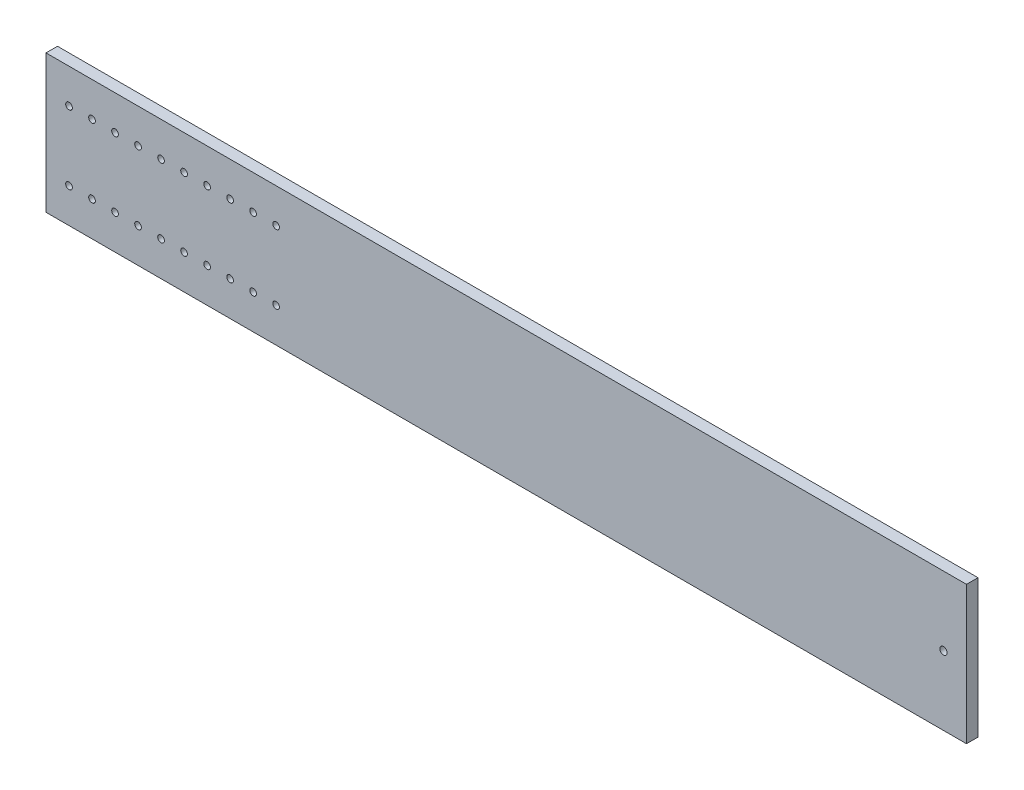
ISO-10303-21;
HEADER;
FILE_DESCRIPTION(('STEP AP214'),'2;1');
FILE_NAME('part.step','',(''),(''),'','','');
FILE_SCHEMA(('AUTOMOTIVE_DESIGN { 1 0 10303 214 1 1 1 1 }'));
ENDSEC;
DATA;
#1=APPLICATION_CONTEXT('core data for automotive mechanical design processes');
#2=APPLICATION_PROTOCOL_DEFINITION('international standard','automotive_design',2000,#1);
#3=PRODUCT_CONTEXT('',#1,'mechanical');
#4=PRODUCT('Part','Part','',(#3));
#5=PRODUCT_RELATED_PRODUCT_CATEGORY('part','',(#4));
#6=PRODUCT_DEFINITION_FORMATION('','',#4);
#7=PRODUCT_DEFINITION_CONTEXT('part definition',#1,'design');
#8=PRODUCT_DEFINITION('design','',#6,#7);
#9=PRODUCT_DEFINITION_SHAPE('','',#8);
#10=(LENGTH_UNIT() NAMED_UNIT(*) SI_UNIT(.MILLI.,.METRE.));
#11=(NAMED_UNIT(*) PLANE_ANGLE_UNIT() SI_UNIT($,.RADIAN.));
#12=(NAMED_UNIT(*) SI_UNIT($,.STERADIAN.) SOLID_ANGLE_UNIT());
#13=UNCERTAINTY_MEASURE_WITH_UNIT(LENGTH_MEASURE(1.E-05),#10,'distance_accuracy_value','');
#14=(GEOMETRIC_REPRESENTATION_CONTEXT(3) GLOBAL_UNCERTAINTY_ASSIGNED_CONTEXT((#13)) GLOBAL_UNIT_ASSIGNED_CONTEXT((#10,
#11,#12)) REPRESENTATION_CONTEXT('',''));
#15=CARTESIAN_POINT('',(0.,0.,0.));
#16=DIRECTION('',(0.,0.,1.));
#17=DIRECTION('',(1.,0.,0.));
#18=AXIS2_PLACEMENT_3D('',#15,#16,#17);
#19=CARTESIAN_POINT('',(0.,0.,6.35));
#20=DIRECTION('',(1.,0.,0.));
#21=DIRECTION('',(0.,0.,-1.));
#22=AXIS2_PLACEMENT_3D('',#19,#20,#21);
#23=PLANE('',#22);
#24=DIRECTION('',(0.,-1.,0.));
#25=VECTOR('',#24,1.);
#26=CARTESIAN_POINT('',(0.,0.,0.));
#27=LINE('',#26,#25);
#28=CARTESIAN_POINT('',(0.,76.2,0.));
#29=VERTEX_POINT('',#28);
#30=CARTESIAN_POINT('',(0.,0.,0.));
#31=VERTEX_POINT('',#30);
#32=EDGE_CURVE('E96',#29,#31,#27,.T.);
#33=ORIENTED_EDGE('',*,*,#32,.T.);
#34=DIRECTION('',(0.,0.,-1.));
#35=VECTOR('',#34,1.);
#36=CARTESIAN_POINT('',(0.,0.,6.35));
#37=LINE('',#36,#35);
#38=CARTESIAN_POINT('',(0.,0.,6.35));
#39=VERTEX_POINT('',#38);
#40=EDGE_CURVE('E11',#39,#31,#37,.T.);
#41=ORIENTED_EDGE('',*,*,#40,.F.);
#42=DIRECTION('',(0.,-1.,0.));
#43=VECTOR('',#42,1.);
#44=CARTESIAN_POINT('',(0.,0.,6.35));
#45=LINE('',#44,#43);
#46=CARTESIAN_POINT('',(0.,76.2,6.35));
#47=VERTEX_POINT('',#46);
#48=EDGE_CURVE('E84',#47,#39,#45,.T.);
#49=ORIENTED_EDGE('',*,*,#48,.F.);
#50=DIRECTION('',(0.,0.,-1.));
#51=VECTOR('',#50,1.);
#52=CARTESIAN_POINT('',(0.,76.2,6.35));
#53=LINE('',#52,#51);
#54=EDGE_CURVE('E92',#47,#29,#53,.T.);
#55=ORIENTED_EDGE('',*,*,#54,.T.);
#56=EDGE_LOOP('',(#33,#41,#49,#55));
#57=FACE_BOUND('',#56,.T.);
#58=ADVANCED_FACE('F33',(#57),#23,.F.);
#59=CARTESIAN_POINT('',(0.,0.,6.35));
#60=DIRECTION('',(0.,1.,0.));
#61=DIRECTION('',(0.,0.,1.));
#62=AXIS2_PLACEMENT_3D('',#59,#60,#61);
#63=PLANE('',#62);
#64=DIRECTION('',(1.,0.,0.));
#65=VECTOR('',#64,1.);
#66=CARTESIAN_POINT('',(0.,0.,0.));
#67=LINE('',#66,#65);
#68=CARTESIAN_POINT('',(508.,0.,0.));
#69=VERTEX_POINT('',#68);
#70=EDGE_CURVE('E88',#31,#69,#67,.T.);
#71=ORIENTED_EDGE('',*,*,#70,.T.);
#72=DIRECTION('',(0.,0.,-1.));
#73=VECTOR('',#72,1.);
#74=CARTESIAN_POINT('',(508.,0.,6.35));
#75=LINE('',#74,#73);
#76=CARTESIAN_POINT('',(508.,0.,6.35));
#77=VERTEX_POINT('',#76);
#78=EDGE_CURVE('E41',#77,#69,#75,.T.);
#79=ORIENTED_EDGE('',*,*,#78,.F.);
#80=DIRECTION('',(1.,0.,0.));
#81=VECTOR('',#80,1.);
#82=CARTESIAN_POINT('',(0.,0.,6.35));
#83=LINE('',#82,#81);
#84=EDGE_CURVE('E79',#39,#77,#83,.T.);
#85=ORIENTED_EDGE('',*,*,#84,.F.);
#86=ORIENTED_EDGE('',*,*,#40,.T.);
#87=EDGE_LOOP('',(#71,#79,#85,#86));
#88=FACE_BOUND('',#87,.T.);
#89=ADVANCED_FACE('F87',(#88),#63,.F.);
#90=CARTESIAN_POINT('',(508.,0.,6.35));
#91=DIRECTION('',(-1.,0.,0.));
#92=DIRECTION('',(0.,0.,1.));
#93=AXIS2_PLACEMENT_3D('',#90,#91,#92);
#94=PLANE('',#93);
#95=DIRECTION('',(0.,1.,0.));
#96=VECTOR('',#95,1.);
#97=CARTESIAN_POINT('',(508.,0.,0.));
#98=LINE('',#97,#96);
#99=CARTESIAN_POINT('',(508.,76.2,0.));
#100=VERTEX_POINT('',#99);
#101=EDGE_CURVE('E66',#69,#100,#98,.T.);
#102=ORIENTED_EDGE('',*,*,#101,.T.);
#103=DIRECTION('',(0.,0.,-1.));
#104=VECTOR('',#103,1.);
#105=CARTESIAN_POINT('',(508.,76.2,6.35));
#106=LINE('',#105,#104);
#107=CARTESIAN_POINT('',(508.,76.2,6.35));
#108=VERTEX_POINT('',#107);
#109=EDGE_CURVE('E89',#108,#100,#106,.T.);
#110=ORIENTED_EDGE('',*,*,#109,.F.);
#111=DIRECTION('',(0.,1.,0.));
#112=VECTOR('',#111,1.);
#113=CARTESIAN_POINT('',(508.,0.,6.35));
#114=LINE('',#113,#112);
#115=EDGE_CURVE('E82',#77,#108,#114,.T.);
#116=ORIENTED_EDGE('',*,*,#115,.F.);
#117=ORIENTED_EDGE('',*,*,#78,.T.);
#118=EDGE_LOOP('',(#102,#110,#116,#117));
#119=FACE_BOUND('',#118,.T.);
#120=ADVANCED_FACE('F90',(#119),#94,.F.);
#121=CARTESIAN_POINT('',(0.,76.2,6.35));
#122=DIRECTION('',(0.,-1.,0.));
#123=DIRECTION('',(0.,0.,-1.));
#124=AXIS2_PLACEMENT_3D('',#121,#122,#123);
#125=PLANE('',#124);
#126=DIRECTION('',(-1.,0.,0.));
#127=VECTOR('',#126,1.);
#128=CARTESIAN_POINT('',(0.,76.2,0.));
#129=LINE('',#128,#127);
#130=EDGE_CURVE('E72',#100,#29,#129,.T.);
#131=ORIENTED_EDGE('',*,*,#130,.T.);
#132=ORIENTED_EDGE('',*,*,#54,.F.);
#133=DIRECTION('',(-1.,0.,0.));
#134=VECTOR('',#133,1.);
#135=CARTESIAN_POINT('',(0.,76.2,6.35));
#136=LINE('',#135,#134);
#137=EDGE_CURVE('E49',#108,#47,#136,.T.);
#138=ORIENTED_EDGE('',*,*,#137,.F.);
#139=ORIENTED_EDGE('',*,*,#109,.T.);
#140=EDGE_LOOP('',(#131,#132,#138,#139));
#141=FACE_BOUND('',#140,.T.);
#142=ADVANCED_FACE('F104',(#141),#125,.F.);
#143=CARTESIAN_POINT('',(0.,76.2,6.35));
#144=DIRECTION('',(0.,0.,-1.));
#145=DIRECTION('',(-1.,0.,0.));
#146=AXIS2_PLACEMENT_3D('',#143,#144,#145);
#147=PLANE('',#146);
#148=CARTESIAN_POINT('',(495.3,38.1,6.35));
#149=DIRECTION('',(0.,0.,1.));
#150=DIRECTION('',(1.,0.,0.));
#151=AXIS2_PLACEMENT_3D('',#148,#149,#150);
#152=CIRCLE('',#151,2.00660000000001);
#153=CARTESIAN_POINT('',(497.3066,38.1,6.35));
#154=VERTEX_POINT('',#153);
#155=EDGE_CURVE('E230',#154,#154,#152,.T.);
#156=ORIENTED_EDGE('',*,*,#155,.F.);
#157=EDGE_LOOP('',(#156));
#158=FACE_BOUND('',#157,.T.);
#159=CARTESIAN_POINT('',(127.,19.05,6.35));
#160=DIRECTION('',(0.,0.,1.));
#161=DIRECTION('',(1.,0.,0.));
#162=AXIS2_PLACEMENT_3D('',#159,#160,#161);
#163=CIRCLE('',#162,1.84150000000001);
#164=CARTESIAN_POINT('',(128.8415,19.05,6.35));
#165=VERTEX_POINT('',#164);
#166=EDGE_CURVE('E224',#165,#165,#163,.T.);
#167=ORIENTED_EDGE('',*,*,#166,.F.);
#168=EDGE_LOOP('',(#167));
#169=FACE_BOUND('',#168,.T.);
#170=CARTESIAN_POINT('',(114.3,19.05,6.35));
#171=DIRECTION('',(0.,0.,1.));
#172=DIRECTION('',(1.,0.,0.));
#173=AXIS2_PLACEMENT_3D('',#170,#171,#172);
#174=CIRCLE('',#173,1.8415);
#175=CARTESIAN_POINT('',(116.1415,19.05,6.35));
#176=VERTEX_POINT('',#175);
#177=EDGE_CURVE('E218',#176,#176,#174,.T.);
#178=ORIENTED_EDGE('',*,*,#177,.F.);
#179=EDGE_LOOP('',(#178));
#180=FACE_BOUND('',#179,.T.);
#181=CARTESIAN_POINT('',(101.6,19.05,6.35));
#182=DIRECTION('',(0.,0.,1.));
#183=DIRECTION('',(1.,0.,0.));
#184=AXIS2_PLACEMENT_3D('',#181,#182,#183);
#185=CIRCLE('',#184,1.8415);
#186=CARTESIAN_POINT('',(103.4415,19.05,6.35));
#187=VERTEX_POINT('',#186);
#188=EDGE_CURVE('E212',#187,#187,#185,.T.);
#189=ORIENTED_EDGE('',*,*,#188,.F.);
#190=EDGE_LOOP('',(#189));
#191=FACE_BOUND('',#190,.T.);
#192=CARTESIAN_POINT('',(88.9000000000004,19.05,6.35));
#193=DIRECTION('',(0.,0.,1.));
#194=DIRECTION('',(1.,0.,0.));
#195=AXIS2_PLACEMENT_3D('',#192,#193,#194);
#196=CIRCLE('',#195,1.8415);
#197=CARTESIAN_POINT('',(90.7415000000004,19.05,6.35));
#198=VERTEX_POINT('',#197);
#199=EDGE_CURVE('E206',#198,#198,#196,.T.);
#200=ORIENTED_EDGE('',*,*,#199,.F.);
#201=EDGE_LOOP('',(#200));
#202=FACE_BOUND('',#201,.T.);
#203=CARTESIAN_POINT('',(76.2000000000004,19.05,6.35));
#204=DIRECTION('',(0.,0.,1.));
#205=DIRECTION('',(1.,0.,0.));
#206=AXIS2_PLACEMENT_3D('',#203,#204,#205);
#207=CIRCLE('',#206,1.8415);
#208=CARTESIAN_POINT('',(78.0415000000004,19.05,6.35));
#209=VERTEX_POINT('',#208);
#210=EDGE_CURVE('E200',#209,#209,#207,.T.);
#211=ORIENTED_EDGE('',*,*,#210,.F.);
#212=EDGE_LOOP('',(#211));
#213=FACE_BOUND('',#212,.T.);
#214=CARTESIAN_POINT('',(63.5000000000004,19.05,6.35));
#215=DIRECTION('',(0.,0.,1.));
#216=DIRECTION('',(1.,0.,0.));
#217=AXIS2_PLACEMENT_3D('',#214,#215,#216);
#218=CIRCLE('',#217,1.8415);
#219=CARTESIAN_POINT('',(65.3415000000004,19.05,6.35));
#220=VERTEX_POINT('',#219);
#221=EDGE_CURVE('E194',#220,#220,#218,.T.);
#222=ORIENTED_EDGE('',*,*,#221,.F.);
#223=EDGE_LOOP('',(#222));
#224=FACE_BOUND('',#223,.T.);
#225=CARTESIAN_POINT('',(50.8000000000004,19.05,6.35));
#226=DIRECTION('',(0.,0.,1.));
#227=DIRECTION('',(1.,0.,0.));
#228=AXIS2_PLACEMENT_3D('',#225,#226,#227);
#229=CIRCLE('',#228,1.8415);
#230=CARTESIAN_POINT('',(52.6415000000004,19.05,6.35));
#231=VERTEX_POINT('',#230);
#232=EDGE_CURVE('E188',#231,#231,#229,.T.);
#233=ORIENTED_EDGE('',*,*,#232,.F.);
#234=EDGE_LOOP('',(#233));
#235=FACE_BOUND('',#234,.T.);
#236=CARTESIAN_POINT('',(38.1000000000004,19.05,6.35));
#237=DIRECTION('',(0.,0.,1.));
#238=DIRECTION('',(1.,0.,0.));
#239=AXIS2_PLACEMENT_3D('',#236,#237,#238);
#240=CIRCLE('',#239,1.8415);
#241=CARTESIAN_POINT('',(39.9415000000004,19.05,6.35));
#242=VERTEX_POINT('',#241);
#243=EDGE_CURVE('E182',#242,#242,#240,.T.);
#244=ORIENTED_EDGE('',*,*,#243,.F.);
#245=EDGE_LOOP('',(#244));
#246=FACE_BOUND('',#245,.T.);
#247=CARTESIAN_POINT('',(25.4000000000004,19.05,6.35));
#248=DIRECTION('',(0.,0.,1.));
#249=DIRECTION('',(1.,0.,0.));
#250=AXIS2_PLACEMENT_3D('',#247,#248,#249);
#251=CIRCLE('',#250,1.8415);
#252=CARTESIAN_POINT('',(27.2415000000004,19.05,6.35));
#253=VERTEX_POINT('',#252);
#254=EDGE_CURVE('E176',#253,#253,#251,.T.);
#255=ORIENTED_EDGE('',*,*,#254,.F.);
#256=EDGE_LOOP('',(#255));
#257=FACE_BOUND('',#256,.T.);
#258=CARTESIAN_POINT('',(12.7000000000004,19.05,6.35));
#259=DIRECTION('',(0.,0.,1.));
#260=DIRECTION('',(1.,0.,0.));
#261=AXIS2_PLACEMENT_3D('',#258,#259,#260);
#262=CIRCLE('',#261,1.8415);
#263=CARTESIAN_POINT('',(14.5415000000004,19.05,6.35));
#264=VERTEX_POINT('',#263);
#265=EDGE_CURVE('E170',#264,#264,#262,.T.);
#266=ORIENTED_EDGE('',*,*,#265,.F.);
#267=EDGE_LOOP('',(#266));
#268=FACE_BOUND('',#267,.T.);
#269=CARTESIAN_POINT('',(127.,57.15,6.35));
#270=DIRECTION('',(0.,0.,1.));
#271=DIRECTION('',(1.,0.,0.));
#272=AXIS2_PLACEMENT_3D('',#269,#270,#271);
#273=CIRCLE('',#272,1.84149999999999);
#274=CARTESIAN_POINT('',(128.8415,57.15,6.35));
#275=VERTEX_POINT('',#274);
#276=EDGE_CURVE('E164',#275,#275,#273,.T.);
#277=ORIENTED_EDGE('',*,*,#276,.F.);
#278=EDGE_LOOP('',(#277));
#279=FACE_BOUND('',#278,.T.);
#280=CARTESIAN_POINT('',(114.3,57.15,6.35));
#281=DIRECTION('',(0.,0.,1.));
#282=DIRECTION('',(1.,0.,0.));
#283=AXIS2_PLACEMENT_3D('',#280,#281,#282);
#284=CIRCLE('',#283,1.8415);
#285=CARTESIAN_POINT('',(116.1415,57.15,6.35));
#286=VERTEX_POINT('',#285);
#287=EDGE_CURVE('E158',#286,#286,#284,.T.);
#288=ORIENTED_EDGE('',*,*,#287,.F.);
#289=EDGE_LOOP('',(#288));
#290=FACE_BOUND('',#289,.T.);
#291=CARTESIAN_POINT('',(101.6,57.15,6.35));
#292=DIRECTION('',(0.,0.,1.));
#293=DIRECTION('',(1.,0.,0.));
#294=AXIS2_PLACEMENT_3D('',#291,#292,#293);
#295=CIRCLE('',#294,1.8415);
#296=CARTESIAN_POINT('',(103.4415,57.15,6.35));
#297=VERTEX_POINT('',#296);
#298=EDGE_CURVE('E152',#297,#297,#295,.T.);
#299=ORIENTED_EDGE('',*,*,#298,.F.);
#300=EDGE_LOOP('',(#299));
#301=FACE_BOUND('',#300,.T.);
#302=CARTESIAN_POINT('',(88.9,57.15,6.35));
#303=DIRECTION('',(0.,0.,1.));
#304=DIRECTION('',(1.,0.,0.));
#305=AXIS2_PLACEMENT_3D('',#302,#303,#304);
#306=CIRCLE('',#305,1.8415);
#307=CARTESIAN_POINT('',(90.7415,57.15,6.35));
#308=VERTEX_POINT('',#307);
#309=EDGE_CURVE('E146',#308,#308,#306,.T.);
#310=ORIENTED_EDGE('',*,*,#309,.F.);
#311=EDGE_LOOP('',(#310));
#312=FACE_BOUND('',#311,.T.);
#313=CARTESIAN_POINT('',(76.2,57.15,6.35));
#314=DIRECTION('',(0.,0.,1.));
#315=DIRECTION('',(1.,0.,0.));
#316=AXIS2_PLACEMENT_3D('',#313,#314,#315);
#317=CIRCLE('',#316,1.8415);
#318=CARTESIAN_POINT('',(78.0415,57.15,6.35));
#319=VERTEX_POINT('',#318);
#320=EDGE_CURVE('E140',#319,#319,#317,.T.);
#321=ORIENTED_EDGE('',*,*,#320,.F.);
#322=EDGE_LOOP('',(#321));
#323=FACE_BOUND('',#322,.T.);
#324=CARTESIAN_POINT('',(63.5,57.15,6.35));
#325=DIRECTION('',(0.,0.,1.));
#326=DIRECTION('',(1.,0.,0.));
#327=AXIS2_PLACEMENT_3D('',#324,#325,#326);
#328=CIRCLE('',#327,1.8415);
#329=CARTESIAN_POINT('',(65.3415,57.15,6.35));
#330=VERTEX_POINT('',#329);
#331=EDGE_CURVE('E134',#330,#330,#328,.T.);
#332=ORIENTED_EDGE('',*,*,#331,.F.);
#333=EDGE_LOOP('',(#332));
#334=FACE_BOUND('',#333,.T.);
#335=CARTESIAN_POINT('',(50.8,57.15,6.35));
#336=DIRECTION('',(0.,0.,1.));
#337=DIRECTION('',(1.,0.,0.));
#338=AXIS2_PLACEMENT_3D('',#335,#336,#337);
#339=CIRCLE('',#338,1.8415);
#340=CARTESIAN_POINT('',(52.6415,57.15,6.35));
#341=VERTEX_POINT('',#340);
#342=EDGE_CURVE('E128',#341,#341,#339,.T.);
#343=ORIENTED_EDGE('',*,*,#342,.F.);
#344=EDGE_LOOP('',(#343));
#345=FACE_BOUND('',#344,.T.);
#346=CARTESIAN_POINT('',(38.1,57.15,6.35));
#347=DIRECTION('',(0.,0.,1.));
#348=DIRECTION('',(1.,0.,0.));
#349=AXIS2_PLACEMENT_3D('',#346,#347,#348);
#350=CIRCLE('',#349,1.8415);
#351=CARTESIAN_POINT('',(39.9415,57.15,6.35));
#352=VERTEX_POINT('',#351);
#353=EDGE_CURVE('E122',#352,#352,#350,.T.);
#354=ORIENTED_EDGE('',*,*,#353,.F.);
#355=EDGE_LOOP('',(#354));
#356=FACE_BOUND('',#355,.T.);
#357=CARTESIAN_POINT('',(25.4,57.15,6.35));
#358=DIRECTION('',(0.,0.,1.));
#359=DIRECTION('',(1.,0.,0.));
#360=AXIS2_PLACEMENT_3D('',#357,#358,#359);
#361=CIRCLE('',#360,1.8415);
#362=CARTESIAN_POINT('',(27.2415,57.15,6.35));
#363=VERTEX_POINT('',#362);
#364=EDGE_CURVE('E116',#363,#363,#361,.T.);
#365=ORIENTED_EDGE('',*,*,#364,.F.);
#366=EDGE_LOOP('',(#365));
#367=FACE_BOUND('',#366,.T.);
#368=CARTESIAN_POINT('',(12.7,57.15,6.35));
#369=DIRECTION('',(0.,0.,1.));
#370=DIRECTION('',(1.,0.,0.));
#371=AXIS2_PLACEMENT_3D('',#368,#369,#370);
#372=CIRCLE('',#371,1.8415);
#373=CARTESIAN_POINT('',(14.5415,57.15,6.35));
#374=VERTEX_POINT('',#373);
#375=EDGE_CURVE('E110',#374,#374,#372,.T.);
#376=ORIENTED_EDGE('',*,*,#375,.F.);
#377=EDGE_LOOP('',(#376));
#378=FACE_BOUND('',#377,.T.);
#379=ORIENTED_EDGE('',*,*,#48,.T.);
#380=ORIENTED_EDGE('',*,*,#84,.T.);
#381=ORIENTED_EDGE('',*,*,#115,.T.);
#382=ORIENTED_EDGE('',*,*,#137,.T.);
#383=EDGE_LOOP('',(#379,#380,#381,#382));
#384=FACE_BOUND('',#383,.T.);
#385=ADVANCED_FACE('F80',(#158,#169,#180,#191,#202,#213,#224,#235,#246,#257,#268,#279,#290,#301,
#312,#323,#334,#345,#356,#367,#378,#384),#147,.F.);
#386=CARTESIAN_POINT('',(0.,76.2,0.));
#387=DIRECTION('',(0.,0.,-1.));
#388=DIRECTION('',(-1.,0.,0.));
#389=AXIS2_PLACEMENT_3D('',#386,#387,#388);
#390=PLANE('',#389);
#391=CARTESIAN_POINT('',(495.3,38.1,0.));
#392=DIRECTION('',(0.,0.,1.));
#393=DIRECTION('',(1.,0.,0.));
#394=AXIS2_PLACEMENT_3D('',#391,#392,#393);
#395=CIRCLE('',#394,2.00660000000001);
#396=CARTESIAN_POINT('',(497.3066,38.1,0.));
#397=VERTEX_POINT('',#396);
#398=EDGE_CURVE('E227',#397,#397,#395,.T.);
#399=ORIENTED_EDGE('',*,*,#398,.T.);
#400=EDGE_LOOP('',(#399));
#401=FACE_BOUND('',#400,.T.);
#402=CARTESIAN_POINT('',(127.,19.05,0.));
#403=DIRECTION('',(0.,0.,1.));
#404=DIRECTION('',(1.,0.,0.));
#405=AXIS2_PLACEMENT_3D('',#402,#403,#404);
#406=CIRCLE('',#405,1.84150000000001);
#407=CARTESIAN_POINT('',(128.8415,19.05,0.));
#408=VERTEX_POINT('',#407);
#409=EDGE_CURVE('E221',#408,#408,#406,.T.);
#410=ORIENTED_EDGE('',*,*,#409,.T.);
#411=EDGE_LOOP('',(#410));
#412=FACE_BOUND('',#411,.T.);
#413=CARTESIAN_POINT('',(114.3,19.05,0.));
#414=DIRECTION('',(0.,0.,1.));
#415=DIRECTION('',(1.,0.,0.));
#416=AXIS2_PLACEMENT_3D('',#413,#414,#415);
#417=CIRCLE('',#416,1.8415);
#418=CARTESIAN_POINT('',(116.1415,19.05,0.));
#419=VERTEX_POINT('',#418);
#420=EDGE_CURVE('E215',#419,#419,#417,.T.);
#421=ORIENTED_EDGE('',*,*,#420,.T.);
#422=EDGE_LOOP('',(#421));
#423=FACE_BOUND('',#422,.T.);
#424=CARTESIAN_POINT('',(101.6,19.05,0.));
#425=DIRECTION('',(0.,0.,1.));
#426=DIRECTION('',(1.,0.,0.));
#427=AXIS2_PLACEMENT_3D('',#424,#425,#426);
#428=CIRCLE('',#427,1.8415);
#429=CARTESIAN_POINT('',(103.4415,19.05,0.));
#430=VERTEX_POINT('',#429);
#431=EDGE_CURVE('E209',#430,#430,#428,.T.);
#432=ORIENTED_EDGE('',*,*,#431,.T.);
#433=EDGE_LOOP('',(#432));
#434=FACE_BOUND('',#433,.T.);
#435=CARTESIAN_POINT('',(88.9000000000004,19.05,0.));
#436=DIRECTION('',(0.,0.,1.));
#437=DIRECTION('',(1.,0.,0.));
#438=AXIS2_PLACEMENT_3D('',#435,#436,#437);
#439=CIRCLE('',#438,1.8415);
#440=CARTESIAN_POINT('',(90.7415000000004,19.05,0.));
#441=VERTEX_POINT('',#440);
#442=EDGE_CURVE('E203',#441,#441,#439,.T.);
#443=ORIENTED_EDGE('',*,*,#442,.T.);
#444=EDGE_LOOP('',(#443));
#445=FACE_BOUND('',#444,.T.);
#446=CARTESIAN_POINT('',(76.2000000000004,19.05,0.));
#447=DIRECTION('',(0.,0.,1.));
#448=DIRECTION('',(1.,0.,0.));
#449=AXIS2_PLACEMENT_3D('',#446,#447,#448);
#450=CIRCLE('',#449,1.8415);
#451=CARTESIAN_POINT('',(78.0415000000004,19.05,0.));
#452=VERTEX_POINT('',#451);
#453=EDGE_CURVE('E197',#452,#452,#450,.T.);
#454=ORIENTED_EDGE('',*,*,#453,.T.);
#455=EDGE_LOOP('',(#454));
#456=FACE_BOUND('',#455,.T.);
#457=CARTESIAN_POINT('',(63.5000000000004,19.05,0.));
#458=DIRECTION('',(0.,0.,1.));
#459=DIRECTION('',(1.,0.,0.));
#460=AXIS2_PLACEMENT_3D('',#457,#458,#459);
#461=CIRCLE('',#460,1.8415);
#462=CARTESIAN_POINT('',(65.3415000000004,19.05,0.));
#463=VERTEX_POINT('',#462);
#464=EDGE_CURVE('E191',#463,#463,#461,.T.);
#465=ORIENTED_EDGE('',*,*,#464,.T.);
#466=EDGE_LOOP('',(#465));
#467=FACE_BOUND('',#466,.T.);
#468=CARTESIAN_POINT('',(50.8000000000004,19.05,0.));
#469=DIRECTION('',(0.,0.,1.));
#470=DIRECTION('',(1.,0.,0.));
#471=AXIS2_PLACEMENT_3D('',#468,#469,#470);
#472=CIRCLE('',#471,1.8415);
#473=CARTESIAN_POINT('',(52.6415000000004,19.05,0.));
#474=VERTEX_POINT('',#473);
#475=EDGE_CURVE('E185',#474,#474,#472,.T.);
#476=ORIENTED_EDGE('',*,*,#475,.T.);
#477=EDGE_LOOP('',(#476));
#478=FACE_BOUND('',#477,.T.);
#479=CARTESIAN_POINT('',(38.1000000000004,19.05,0.));
#480=DIRECTION('',(0.,0.,1.));
#481=DIRECTION('',(1.,0.,0.));
#482=AXIS2_PLACEMENT_3D('',#479,#480,#481);
#483=CIRCLE('',#482,1.8415);
#484=CARTESIAN_POINT('',(39.9415000000004,19.05,0.));
#485=VERTEX_POINT('',#484);
#486=EDGE_CURVE('E179',#485,#485,#483,.T.);
#487=ORIENTED_EDGE('',*,*,#486,.T.);
#488=EDGE_LOOP('',(#487));
#489=FACE_BOUND('',#488,.T.);
#490=CARTESIAN_POINT('',(25.4000000000004,19.05,0.));
#491=DIRECTION('',(0.,0.,1.));
#492=DIRECTION('',(1.,0.,0.));
#493=AXIS2_PLACEMENT_3D('',#490,#491,#492);
#494=CIRCLE('',#493,1.8415);
#495=CARTESIAN_POINT('',(27.2415000000004,19.05,0.));
#496=VERTEX_POINT('',#495);
#497=EDGE_CURVE('E173',#496,#496,#494,.T.);
#498=ORIENTED_EDGE('',*,*,#497,.T.);
#499=EDGE_LOOP('',(#498));
#500=FACE_BOUND('',#499,.T.);
#501=CARTESIAN_POINT('',(12.7000000000004,19.05,0.));
#502=DIRECTION('',(0.,0.,1.));
#503=DIRECTION('',(1.,0.,0.));
#504=AXIS2_PLACEMENT_3D('',#501,#502,#503);
#505=CIRCLE('',#504,1.8415);
#506=CARTESIAN_POINT('',(14.5415000000004,19.05,0.));
#507=VERTEX_POINT('',#506);
#508=EDGE_CURVE('E167',#507,#507,#505,.T.);
#509=ORIENTED_EDGE('',*,*,#508,.T.);
#510=EDGE_LOOP('',(#509));
#511=FACE_BOUND('',#510,.T.);
#512=CARTESIAN_POINT('',(127.,57.15,0.));
#513=DIRECTION('',(0.,0.,1.));
#514=DIRECTION('',(1.,0.,0.));
#515=AXIS2_PLACEMENT_3D('',#512,#513,#514);
#516=CIRCLE('',#515,1.84149999999999);
#517=CARTESIAN_POINT('',(128.8415,57.15,0.));
#518=VERTEX_POINT('',#517);
#519=EDGE_CURVE('E161',#518,#518,#516,.T.);
#520=ORIENTED_EDGE('',*,*,#519,.T.);
#521=EDGE_LOOP('',(#520));
#522=FACE_BOUND('',#521,.T.);
#523=CARTESIAN_POINT('',(114.3,57.15,0.));
#524=DIRECTION('',(0.,0.,1.));
#525=DIRECTION('',(1.,0.,0.));
#526=AXIS2_PLACEMENT_3D('',#523,#524,#525);
#527=CIRCLE('',#526,1.8415);
#528=CARTESIAN_POINT('',(116.1415,57.15,0.));
#529=VERTEX_POINT('',#528);
#530=EDGE_CURVE('E155',#529,#529,#527,.T.);
#531=ORIENTED_EDGE('',*,*,#530,.T.);
#532=EDGE_LOOP('',(#531));
#533=FACE_BOUND('',#532,.T.);
#534=CARTESIAN_POINT('',(101.6,57.15,0.));
#535=DIRECTION('',(0.,0.,1.));
#536=DIRECTION('',(1.,0.,0.));
#537=AXIS2_PLACEMENT_3D('',#534,#535,#536);
#538=CIRCLE('',#537,1.8415);
#539=CARTESIAN_POINT('',(103.4415,57.15,0.));
#540=VERTEX_POINT('',#539);
#541=EDGE_CURVE('E149',#540,#540,#538,.T.);
#542=ORIENTED_EDGE('',*,*,#541,.T.);
#543=EDGE_LOOP('',(#542));
#544=FACE_BOUND('',#543,.T.);
#545=CARTESIAN_POINT('',(88.9,57.15,0.));
#546=DIRECTION('',(0.,0.,1.));
#547=DIRECTION('',(1.,0.,0.));
#548=AXIS2_PLACEMENT_3D('',#545,#546,#547);
#549=CIRCLE('',#548,1.8415);
#550=CARTESIAN_POINT('',(90.7415,57.15,0.));
#551=VERTEX_POINT('',#550);
#552=EDGE_CURVE('E143',#551,#551,#549,.T.);
#553=ORIENTED_EDGE('',*,*,#552,.T.);
#554=EDGE_LOOP('',(#553));
#555=FACE_BOUND('',#554,.T.);
#556=CARTESIAN_POINT('',(76.2,57.15,0.));
#557=DIRECTION('',(0.,0.,1.));
#558=DIRECTION('',(1.,0.,0.));
#559=AXIS2_PLACEMENT_3D('',#556,#557,#558);
#560=CIRCLE('',#559,1.8415);
#561=CARTESIAN_POINT('',(78.0415,57.15,0.));
#562=VERTEX_POINT('',#561);
#563=EDGE_CURVE('E137',#562,#562,#560,.T.);
#564=ORIENTED_EDGE('',*,*,#563,.T.);
#565=EDGE_LOOP('',(#564));
#566=FACE_BOUND('',#565,.T.);
#567=CARTESIAN_POINT('',(63.5,57.15,0.));
#568=DIRECTION('',(0.,0.,1.));
#569=DIRECTION('',(1.,0.,0.));
#570=AXIS2_PLACEMENT_3D('',#567,#568,#569);
#571=CIRCLE('',#570,1.8415);
#572=CARTESIAN_POINT('',(65.3415,57.15,0.));
#573=VERTEX_POINT('',#572);
#574=EDGE_CURVE('E131',#573,#573,#571,.T.);
#575=ORIENTED_EDGE('',*,*,#574,.T.);
#576=EDGE_LOOP('',(#575));
#577=FACE_BOUND('',#576,.T.);
#578=CARTESIAN_POINT('',(50.8,57.15,0.));
#579=DIRECTION('',(0.,0.,1.));
#580=DIRECTION('',(1.,0.,0.));
#581=AXIS2_PLACEMENT_3D('',#578,#579,#580);
#582=CIRCLE('',#581,1.8415);
#583=CARTESIAN_POINT('',(52.6415,57.15,0.));
#584=VERTEX_POINT('',#583);
#585=EDGE_CURVE('E125',#584,#584,#582,.T.);
#586=ORIENTED_EDGE('',*,*,#585,.T.);
#587=EDGE_LOOP('',(#586));
#588=FACE_BOUND('',#587,.T.);
#589=CARTESIAN_POINT('',(38.1,57.15,0.));
#590=DIRECTION('',(0.,0.,1.));
#591=DIRECTION('',(1.,0.,0.));
#592=AXIS2_PLACEMENT_3D('',#589,#590,#591);
#593=CIRCLE('',#592,1.8415);
#594=CARTESIAN_POINT('',(39.9415,57.15,0.));
#595=VERTEX_POINT('',#594);
#596=EDGE_CURVE('E119',#595,#595,#593,.T.);
#597=ORIENTED_EDGE('',*,*,#596,.T.);
#598=EDGE_LOOP('',(#597));
#599=FACE_BOUND('',#598,.T.);
#600=CARTESIAN_POINT('',(25.4,57.15,0.));
#601=DIRECTION('',(0.,0.,1.));
#602=DIRECTION('',(1.,0.,0.));
#603=AXIS2_PLACEMENT_3D('',#600,#601,#602);
#604=CIRCLE('',#603,1.8415);
#605=CARTESIAN_POINT('',(27.2415,57.15,0.));
#606=VERTEX_POINT('',#605);
#607=EDGE_CURVE('E113',#606,#606,#604,.T.);
#608=ORIENTED_EDGE('',*,*,#607,.T.);
#609=EDGE_LOOP('',(#608));
#610=FACE_BOUND('',#609,.T.);
#611=CARTESIAN_POINT('',(12.7,57.15,0.));
#612=DIRECTION('',(0.,0.,1.));
#613=DIRECTION('',(1.,0.,0.));
#614=AXIS2_PLACEMENT_3D('',#611,#612,#613);
#615=CIRCLE('',#614,1.8415);
#616=CARTESIAN_POINT('',(14.5415,57.15,0.));
#617=VERTEX_POINT('',#616);
#618=EDGE_CURVE('E99',#617,#617,#615,.T.);
#619=ORIENTED_EDGE('',*,*,#618,.T.);
#620=EDGE_LOOP('',(#619));
#621=FACE_BOUND('',#620,.T.);
#622=ORIENTED_EDGE('',*,*,#32,.F.);
#623=ORIENTED_EDGE('',*,*,#130,.F.);
#624=ORIENTED_EDGE('',*,*,#101,.F.);
#625=ORIENTED_EDGE('',*,*,#70,.F.);
#626=EDGE_LOOP('',(#622,#623,#624,#625));
#627=FACE_BOUND('',#626,.T.);
#628=ADVANCED_FACE('F107',(#401,#412,#423,#434,#445,#456,#467,#478,#489,#500,#511,#522,#533,
#544,#555,#566,#577,#588,#599,#610,#621,#627),#390,.T.);
#629=CARTESIAN_POINT('',(12.7,57.15,0.));
#630=DIRECTION('',(0.,0.,1.));
#631=DIRECTION('',(1.,0.,0.));
#632=AXIS2_PLACEMENT_3D('',#629,#630,#631);
#633=CYLINDRICAL_SURFACE('',#632,1.8415);
#634=ORIENTED_EDGE('',*,*,#618,.F.);
#635=EDGE_LOOP('',(#634));
#636=FACE_BOUND('',#635,.T.);
#637=ORIENTED_EDGE('',*,*,#375,.T.);
#638=EDGE_LOOP('',(#637));
#639=FACE_BOUND('',#638,.T.);
#640=ADVANCED_FACE('F288',(#636,#639),#633,.F.);
#641=CARTESIAN_POINT('',(25.4,57.15,0.));
#642=DIRECTION('',(0.,0.,1.));
#643=DIRECTION('',(1.,0.,0.));
#644=AXIS2_PLACEMENT_3D('',#641,#642,#643);
#645=CYLINDRICAL_SURFACE('',#644,1.8415);
#646=ORIENTED_EDGE('',*,*,#607,.F.);
#647=EDGE_LOOP('',(#646));
#648=FACE_BOUND('',#647,.T.);
#649=ORIENTED_EDGE('',*,*,#364,.T.);
#650=EDGE_LOOP('',(#649));
#651=FACE_BOUND('',#650,.T.);
#652=ADVANCED_FACE('F290',(#648,#651),#645,.F.);
#653=CARTESIAN_POINT('',(38.1,57.15,0.));
#654=DIRECTION('',(0.,0.,1.));
#655=DIRECTION('',(1.,0.,0.));
#656=AXIS2_PLACEMENT_3D('',#653,#654,#655);
#657=CYLINDRICAL_SURFACE('',#656,1.8415);
#658=ORIENTED_EDGE('',*,*,#596,.F.);
#659=EDGE_LOOP('',(#658));
#660=FACE_BOUND('',#659,.T.);
#661=ORIENTED_EDGE('',*,*,#353,.T.);
#662=EDGE_LOOP('',(#661));
#663=FACE_BOUND('',#662,.T.);
#664=ADVANCED_FACE('F297',(#660,#663),#657,.F.);
#665=CARTESIAN_POINT('',(50.8,57.15,0.));
#666=DIRECTION('',(0.,0.,1.));
#667=DIRECTION('',(1.,0.,0.));
#668=AXIS2_PLACEMENT_3D('',#665,#666,#667);
#669=CYLINDRICAL_SURFACE('',#668,1.8415);
#670=ORIENTED_EDGE('',*,*,#585,.F.);
#671=EDGE_LOOP('',(#670));
#672=FACE_BOUND('',#671,.T.);
#673=ORIENTED_EDGE('',*,*,#342,.T.);
#674=EDGE_LOOP('',(#673));
#675=FACE_BOUND('',#674,.T.);
#676=ADVANCED_FACE('F459',(#672,#675),#669,.F.);
#677=CARTESIAN_POINT('',(63.5,57.15,0.));
#678=DIRECTION('',(0.,0.,1.));
#679=DIRECTION('',(1.,0.,0.));
#680=AXIS2_PLACEMENT_3D('',#677,#678,#679);
#681=CYLINDRICAL_SURFACE('',#680,1.8415);
#682=ORIENTED_EDGE('',*,*,#574,.F.);
#683=EDGE_LOOP('',(#682));
#684=FACE_BOUND('',#683,.T.);
#685=ORIENTED_EDGE('',*,*,#331,.T.);
#686=EDGE_LOOP('',(#685));
#687=FACE_BOUND('',#686,.T.);
#688=ADVANCED_FACE('F451',(#684,#687),#681,.F.);
#689=CARTESIAN_POINT('',(76.2,57.15,0.));
#690=DIRECTION('',(0.,0.,1.));
#691=DIRECTION('',(1.,0.,0.));
#692=AXIS2_PLACEMENT_3D('',#689,#690,#691);
#693=CYLINDRICAL_SURFACE('',#692,1.8415);
#694=ORIENTED_EDGE('',*,*,#563,.F.);
#695=EDGE_LOOP('',(#694));
#696=FACE_BOUND('',#695,.T.);
#697=ORIENTED_EDGE('',*,*,#320,.T.);
#698=EDGE_LOOP('',(#697));
#699=FACE_BOUND('',#698,.T.);
#700=ADVANCED_FACE('F443',(#696,#699),#693,.F.);
#701=CARTESIAN_POINT('',(88.9,57.15,0.));
#702=DIRECTION('',(0.,0.,1.));
#703=DIRECTION('',(1.,0.,0.));
#704=AXIS2_PLACEMENT_3D('',#701,#702,#703);
#705=CYLINDRICAL_SURFACE('',#704,1.8415);
#706=ORIENTED_EDGE('',*,*,#552,.F.);
#707=EDGE_LOOP('',(#706));
#708=FACE_BOUND('',#707,.T.);
#709=ORIENTED_EDGE('',*,*,#309,.T.);
#710=EDGE_LOOP('',(#709));
#711=FACE_BOUND('',#710,.T.);
#712=ADVANCED_FACE('F435',(#708,#711),#705,.F.);
#713=CARTESIAN_POINT('',(101.6,57.15,0.));
#714=DIRECTION('',(0.,0.,1.));
#715=DIRECTION('',(1.,0.,0.));
#716=AXIS2_PLACEMENT_3D('',#713,#714,#715);
#717=CYLINDRICAL_SURFACE('',#716,1.8415);
#718=ORIENTED_EDGE('',*,*,#541,.F.);
#719=EDGE_LOOP('',(#718));
#720=FACE_BOUND('',#719,.T.);
#721=ORIENTED_EDGE('',*,*,#298,.T.);
#722=EDGE_LOOP('',(#721));
#723=FACE_BOUND('',#722,.T.);
#724=ADVANCED_FACE('F427',(#720,#723),#717,.F.);
#725=CARTESIAN_POINT('',(114.3,57.15,0.));
#726=DIRECTION('',(0.,0.,1.));
#727=DIRECTION('',(1.,0.,0.));
#728=AXIS2_PLACEMENT_3D('',#725,#726,#727);
#729=CYLINDRICAL_SURFACE('',#728,1.8415);
#730=ORIENTED_EDGE('',*,*,#530,.F.);
#731=EDGE_LOOP('',(#730));
#732=FACE_BOUND('',#731,.T.);
#733=ORIENTED_EDGE('',*,*,#287,.T.);
#734=EDGE_LOOP('',(#733));
#735=FACE_BOUND('',#734,.T.);
#736=ADVANCED_FACE('F419',(#732,#735),#729,.F.);
#737=CARTESIAN_POINT('',(127.,57.15,0.));
#738=DIRECTION('',(0.,0.,1.));
#739=DIRECTION('',(1.,0.,0.));
#740=AXIS2_PLACEMENT_3D('',#737,#738,#739);
#741=CYLINDRICAL_SURFACE('',#740,1.84149999999999);
#742=ORIENTED_EDGE('',*,*,#519,.F.);
#743=EDGE_LOOP('',(#742));
#744=FACE_BOUND('',#743,.T.);
#745=ORIENTED_EDGE('',*,*,#276,.T.);
#746=EDGE_LOOP('',(#745));
#747=FACE_BOUND('',#746,.T.);
#748=ADVANCED_FACE('F411',(#744,#747),#741,.F.);
#749=CARTESIAN_POINT('',(12.7000000000004,19.05,0.));
#750=DIRECTION('',(0.,0.,1.));
#751=DIRECTION('',(1.,0.,0.));
#752=AXIS2_PLACEMENT_3D('',#749,#750,#751);
#753=CYLINDRICAL_SURFACE('',#752,1.8415);
#754=ORIENTED_EDGE('',*,*,#508,.F.);
#755=EDGE_LOOP('',(#754));
#756=FACE_BOUND('',#755,.T.);
#757=ORIENTED_EDGE('',*,*,#265,.T.);
#758=EDGE_LOOP('',(#757));
#759=FACE_BOUND('',#758,.T.);
#760=ADVANCED_FACE('F403',(#756,#759),#753,.F.);
#761=CARTESIAN_POINT('',(25.4000000000004,19.05,0.));
#762=DIRECTION('',(0.,0.,1.));
#763=DIRECTION('',(1.,0.,0.));
#764=AXIS2_PLACEMENT_3D('',#761,#762,#763);
#765=CYLINDRICAL_SURFACE('',#764,1.8415);
#766=ORIENTED_EDGE('',*,*,#497,.F.);
#767=EDGE_LOOP('',(#766));
#768=FACE_BOUND('',#767,.T.);
#769=ORIENTED_EDGE('',*,*,#254,.T.);
#770=EDGE_LOOP('',(#769));
#771=FACE_BOUND('',#770,.T.);
#772=ADVANCED_FACE('F395',(#768,#771),#765,.F.);
#773=CARTESIAN_POINT('',(38.1000000000004,19.05,0.));
#774=DIRECTION('',(0.,0.,1.));
#775=DIRECTION('',(1.,0.,0.));
#776=AXIS2_PLACEMENT_3D('',#773,#774,#775);
#777=CYLINDRICAL_SURFACE('',#776,1.8415);
#778=ORIENTED_EDGE('',*,*,#486,.F.);
#779=EDGE_LOOP('',(#778));
#780=FACE_BOUND('',#779,.T.);
#781=ORIENTED_EDGE('',*,*,#243,.T.);
#782=EDGE_LOOP('',(#781));
#783=FACE_BOUND('',#782,.T.);
#784=ADVANCED_FACE('F387',(#780,#783),#777,.F.);
#785=CARTESIAN_POINT('',(50.8000000000004,19.05,0.));
#786=DIRECTION('',(0.,0.,1.));
#787=DIRECTION('',(1.,0.,0.));
#788=AXIS2_PLACEMENT_3D('',#785,#786,#787);
#789=CYLINDRICAL_SURFACE('',#788,1.8415);
#790=ORIENTED_EDGE('',*,*,#475,.F.);
#791=EDGE_LOOP('',(#790));
#792=FACE_BOUND('',#791,.T.);
#793=ORIENTED_EDGE('',*,*,#232,.T.);
#794=EDGE_LOOP('',(#793));
#795=FACE_BOUND('',#794,.T.);
#796=ADVANCED_FACE('F379',(#792,#795),#789,.F.);
#797=CARTESIAN_POINT('',(63.5000000000004,19.05,0.));
#798=DIRECTION('',(0.,0.,1.));
#799=DIRECTION('',(1.,0.,0.));
#800=AXIS2_PLACEMENT_3D('',#797,#798,#799);
#801=CYLINDRICAL_SURFACE('',#800,1.8415);
#802=ORIENTED_EDGE('',*,*,#464,.F.);
#803=EDGE_LOOP('',(#802));
#804=FACE_BOUND('',#803,.T.);
#805=ORIENTED_EDGE('',*,*,#221,.T.);
#806=EDGE_LOOP('',(#805));
#807=FACE_BOUND('',#806,.T.);
#808=ADVANCED_FACE('F371',(#804,#807),#801,.F.);
#809=CARTESIAN_POINT('',(76.2000000000004,19.05,0.));
#810=DIRECTION('',(0.,0.,1.));
#811=DIRECTION('',(1.,0.,0.));
#812=AXIS2_PLACEMENT_3D('',#809,#810,#811);
#813=CYLINDRICAL_SURFACE('',#812,1.8415);
#814=ORIENTED_EDGE('',*,*,#453,.F.);
#815=EDGE_LOOP('',(#814));
#816=FACE_BOUND('',#815,.T.);
#817=ORIENTED_EDGE('',*,*,#210,.T.);
#818=EDGE_LOOP('',(#817));
#819=FACE_BOUND('',#818,.T.);
#820=ADVANCED_FACE('F363',(#816,#819),#813,.F.);
#821=CARTESIAN_POINT('',(88.9000000000004,19.05,0.));
#822=DIRECTION('',(0.,0.,1.));
#823=DIRECTION('',(1.,0.,0.));
#824=AXIS2_PLACEMENT_3D('',#821,#822,#823);
#825=CYLINDRICAL_SURFACE('',#824,1.8415);
#826=ORIENTED_EDGE('',*,*,#442,.F.);
#827=EDGE_LOOP('',(#826));
#828=FACE_BOUND('',#827,.T.);
#829=ORIENTED_EDGE('',*,*,#199,.T.);
#830=EDGE_LOOP('',(#829));
#831=FACE_BOUND('',#830,.T.);
#832=ADVANCED_FACE('F355',(#828,#831),#825,.F.);
#833=CARTESIAN_POINT('',(101.6,19.05,0.));
#834=DIRECTION('',(0.,0.,1.));
#835=DIRECTION('',(1.,0.,0.));
#836=AXIS2_PLACEMENT_3D('',#833,#834,#835);
#837=CYLINDRICAL_SURFACE('',#836,1.8415);
#838=ORIENTED_EDGE('',*,*,#431,.F.);
#839=EDGE_LOOP('',(#838));
#840=FACE_BOUND('',#839,.T.);
#841=ORIENTED_EDGE('',*,*,#188,.T.);
#842=EDGE_LOOP('',(#841));
#843=FACE_BOUND('',#842,.T.);
#844=ADVANCED_FACE('F347',(#840,#843),#837,.F.);
#845=CARTESIAN_POINT('',(114.3,19.05,0.));
#846=DIRECTION('',(0.,0.,1.));
#847=DIRECTION('',(1.,0.,0.));
#848=AXIS2_PLACEMENT_3D('',#845,#846,#847);
#849=CYLINDRICAL_SURFACE('',#848,1.8415);
#850=ORIENTED_EDGE('',*,*,#420,.F.);
#851=EDGE_LOOP('',(#850));
#852=FACE_BOUND('',#851,.T.);
#853=ORIENTED_EDGE('',*,*,#177,.T.);
#854=EDGE_LOOP('',(#853));
#855=FACE_BOUND('',#854,.T.);
#856=ADVANCED_FACE('F340',(#852,#855),#849,.F.);
#857=CARTESIAN_POINT('',(127.,19.05,0.));
#858=DIRECTION('',(0.,0.,1.));
#859=DIRECTION('',(1.,0.,0.));
#860=AXIS2_PLACEMENT_3D('',#857,#858,#859);
#861=CYLINDRICAL_SURFACE('',#860,1.84150000000001);
#862=ORIENTED_EDGE('',*,*,#409,.F.);
#863=EDGE_LOOP('',(#862));
#864=FACE_BOUND('',#863,.T.);
#865=ORIENTED_EDGE('',*,*,#166,.T.);
#866=EDGE_LOOP('',(#865));
#867=FACE_BOUND('',#866,.T.);
#868=ADVANCED_FACE('F241',(#864,#867),#861,.F.);
#869=CARTESIAN_POINT('',(495.3,38.1,0.));
#870=DIRECTION('',(0.,0.,1.));
#871=DIRECTION('',(1.,0.,0.));
#872=AXIS2_PLACEMENT_3D('',#869,#870,#871);
#873=CYLINDRICAL_SURFACE('',#872,2.00660000000001);
#874=ORIENTED_EDGE('',*,*,#398,.F.);
#875=EDGE_LOOP('',(#874));
#876=FACE_BOUND('',#875,.T.);
#877=ORIENTED_EDGE('',*,*,#155,.T.);
#878=EDGE_LOOP('',(#877));
#879=FACE_BOUND('',#878,.T.);
#880=ADVANCED_FACE('F238',(#876,#879),#873,.F.);
#881=CLOSED_SHELL('',(#58,#89,#120,#142,#385,#628,#640,#652,#664,#676,#688,#700,#712,#724,#736,
#748,#760,#772,#784,#796,#808,#820,#832,#844,#856,#868,#880));
#882=MANIFOLD_SOLID_BREP('B2',#881);
#883=ADVANCED_BREP_SHAPE_REPRESENTATION('',(#18,#882),#14);
#884=SHAPE_DEFINITION_REPRESENTATION(#9,#883);
ENDSEC;
END-ISO-10303-21;
